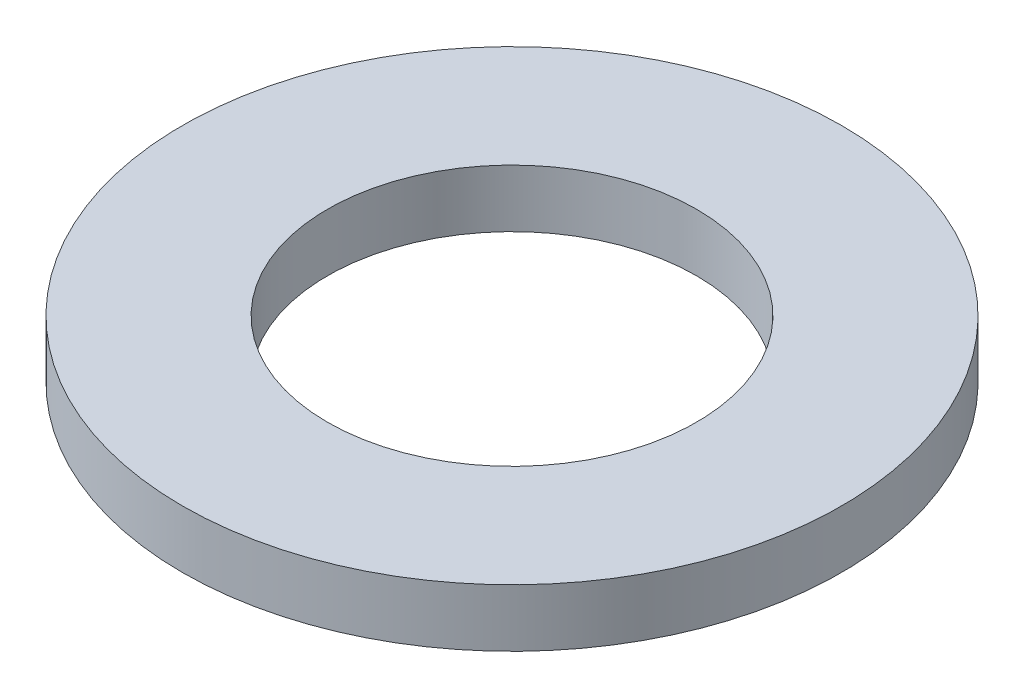
ISO-10303-21;
HEADER;
FILE_DESCRIPTION(('STEP AP214'),'2;1');
FILE_NAME('part.step','',(''),(''),'','','');
FILE_SCHEMA(('AUTOMOTIVE_DESIGN { 1 0 10303 214 1 1 1 1 }'));
ENDSEC;
DATA;
#1=APPLICATION_CONTEXT('core data for automotive mechanical design processes');
#2=APPLICATION_PROTOCOL_DEFINITION('international standard','automotive_design',2000,#1);
#3=PRODUCT_CONTEXT('',#1,'mechanical');
#4=PRODUCT('Part','Part','',(#3));
#5=PRODUCT_RELATED_PRODUCT_CATEGORY('part','',(#4));
#6=PRODUCT_DEFINITION_FORMATION('','',#4);
#7=PRODUCT_DEFINITION_CONTEXT('part definition',#1,'design');
#8=PRODUCT_DEFINITION('design','',#6,#7);
#9=PRODUCT_DEFINITION_SHAPE('','',#8);
#10=(LENGTH_UNIT() NAMED_UNIT(*) SI_UNIT(.MILLI.,.METRE.));
#11=(NAMED_UNIT(*) PLANE_ANGLE_UNIT() SI_UNIT($,.RADIAN.));
#12=(NAMED_UNIT(*) SI_UNIT($,.STERADIAN.) SOLID_ANGLE_UNIT());
#13=UNCERTAINTY_MEASURE_WITH_UNIT(LENGTH_MEASURE(1.E-05),#10,'distance_accuracy_value','');
#14=(GEOMETRIC_REPRESENTATION_CONTEXT(3) GLOBAL_UNCERTAINTY_ASSIGNED_CONTEXT((#13)) GLOBAL_UNIT_ASSIGNED_CONTEXT((#10,
#11,#12)) REPRESENTATION_CONTEXT('',''));
#15=CARTESIAN_POINT('',(0.,0.,0.));
#16=DIRECTION('',(0.,0.,1.));
#17=DIRECTION('',(1.,0.,0.));
#18=AXIS2_PLACEMENT_3D('',#15,#16,#17);
#19=CARTESIAN_POINT('',(0.,5.,0.));
#20=DIRECTION('',(0.,-1.,0.));
#21=DIRECTION('',(0.,0.,-1.));
#22=AXIS2_PLACEMENT_3D('',#19,#20,#21);
#23=CYLINDRICAL_SURFACE('',#22,28.575);
#24=CARTESIAN_POINT('',(0.,5.,0.));
#25=DIRECTION('',(0.,1.,0.));
#26=DIRECTION('',(0.,0.,1.));
#27=AXIS2_PLACEMENT_3D('',#24,#25,#26);
#28=CIRCLE('',#27,28.575);
#29=CARTESIAN_POINT('',(0.,5.,28.575));
#30=VERTEX_POINT('',#29);
#31=EDGE_CURVE('E10',#30,#30,#28,.T.);
#32=ORIENTED_EDGE('',*,*,#31,.F.);
#33=EDGE_LOOP('',(#32));
#34=FACE_BOUND('',#33,.T.);
#35=CARTESIAN_POINT('',(0.,0.,0.));
#36=DIRECTION('',(0.,1.,0.));
#37=DIRECTION('',(0.,0.,1.));
#38=AXIS2_PLACEMENT_3D('',#35,#36,#37);
#39=CIRCLE('',#38,28.575);
#40=CARTESIAN_POINT('',(0.,0.,28.575));
#41=VERTEX_POINT('',#40);
#42=EDGE_CURVE('E32',#41,#41,#39,.T.);
#43=ORIENTED_EDGE('',*,*,#42,.T.);
#44=EDGE_LOOP('',(#43));
#45=FACE_BOUND('',#44,.T.);
#46=ADVANCED_FACE('F29',(#34,#45),#23,.T.);
#47=CARTESIAN_POINT('',(0.,5.,0.));
#48=DIRECTION('',(0.,1.,0.));
#49=DIRECTION('',(0.,0.,1.));
#50=AXIS2_PLACEMENT_3D('',#47,#48,#49);
#51=PLANE('',#50);
#52=CARTESIAN_POINT('',(0.,5.,0.));
#53=DIRECTION('',(0.,1.,0.));
#54=DIRECTION('',(0.,0.,1.));
#55=AXIS2_PLACEMENT_3D('',#52,#53,#54);
#56=CIRCLE('',#55,16.);
#57=CARTESIAN_POINT('',(0.,5.,16.));
#58=VERTEX_POINT('',#57);
#59=EDGE_CURVE('E41',#58,#58,#56,.T.);
#60=ORIENTED_EDGE('',*,*,#59,.F.);
#61=EDGE_LOOP('',(#60));
#62=FACE_BOUND('',#61,.T.);
#63=ORIENTED_EDGE('',*,*,#31,.T.);
#64=EDGE_LOOP('',(#63));
#65=FACE_BOUND('',#64,.T.);
#66=ADVANCED_FACE('F56',(#62,#65),#51,.T.);
#67=CARTESIAN_POINT('',(0.,0.,0.));
#68=DIRECTION('',(0.,1.,0.));
#69=DIRECTION('',(0.,0.,1.));
#70=AXIS2_PLACEMENT_3D('',#67,#68,#69);
#71=PLANE('',#70);
#72=CARTESIAN_POINT('',(0.,0.,0.));
#73=DIRECTION('',(0.,1.,0.));
#74=DIRECTION('',(0.,0.,1.));
#75=AXIS2_PLACEMENT_3D('',#72,#73,#74);
#76=CIRCLE('',#75,16.);
#77=CARTESIAN_POINT('',(0.,0.,16.));
#78=VERTEX_POINT('',#77);
#79=EDGE_CURVE('E39',#78,#78,#76,.T.);
#80=ORIENTED_EDGE('',*,*,#79,.T.);
#81=EDGE_LOOP('',(#80));
#82=FACE_BOUND('',#81,.T.);
#83=ORIENTED_EDGE('',*,*,#42,.F.);
#84=EDGE_LOOP('',(#83));
#85=FACE_BOUND('',#84,.T.);
#86=ADVANCED_FACE('F47',(#82,#85),#71,.F.);
#87=CARTESIAN_POINT('',(0.,0.,0.));
#88=DIRECTION('',(0.,1.,0.));
#89=DIRECTION('',(0.,0.,1.));
#90=AXIS2_PLACEMENT_3D('',#87,#88,#89);
#91=CYLINDRICAL_SURFACE('',#90,16.);
#92=ORIENTED_EDGE('',*,*,#79,.F.);
#93=EDGE_LOOP('',(#92));
#94=FACE_BOUND('',#93,.T.);
#95=ORIENTED_EDGE('',*,*,#59,.T.);
#96=EDGE_LOOP('',(#95));
#97=FACE_BOUND('',#96,.T.);
#98=ADVANCED_FACE('F50',(#94,#97),#91,.F.);
#99=CLOSED_SHELL('',(#46,#66,#86,#98));
#100=MANIFOLD_SOLID_BREP('B2',#99);
#101=ADVANCED_BREP_SHAPE_REPRESENTATION('',(#18,#100),#14);
#102=SHAPE_DEFINITION_REPRESENTATION(#9,#101);
ENDSEC;
END-ISO-10303-21;
